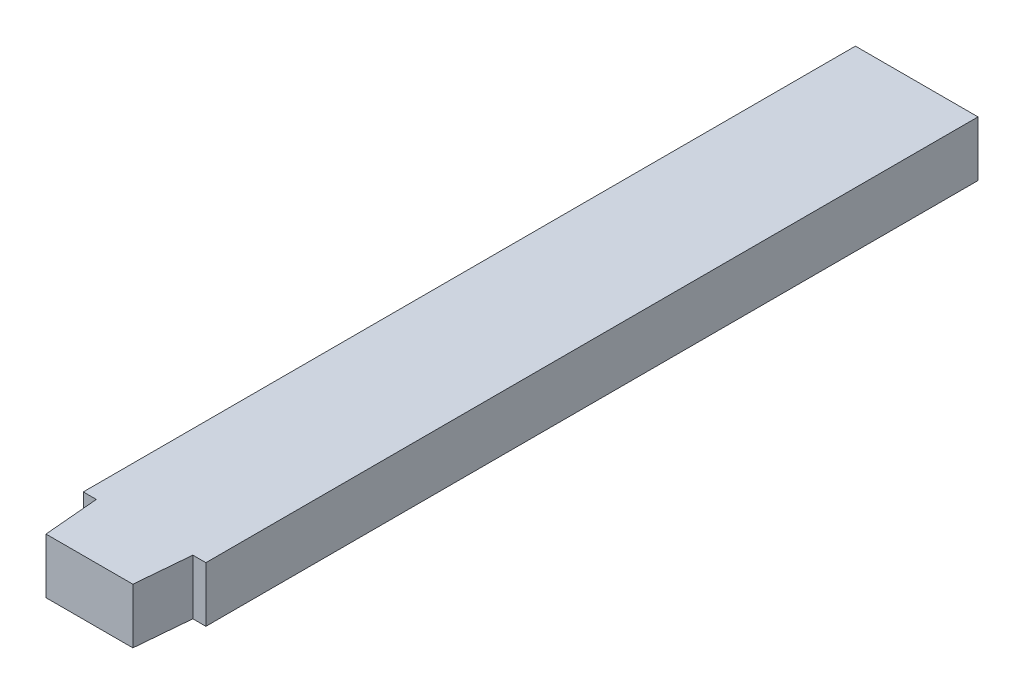
ISO-10303-21;
HEADER;
FILE_DESCRIPTION(('STEP AP214'),'2;1');
FILE_NAME('part.step','',(''),(''),'','','');
FILE_SCHEMA(('AUTOMOTIVE_DESIGN { 1 0 10303 214 1 1 1 1 }'));
ENDSEC;
DATA;
#1=APPLICATION_CONTEXT('core data for automotive mechanical design processes');
#2=APPLICATION_PROTOCOL_DEFINITION('international standard','automotive_design',2000,#1);
#3=PRODUCT_CONTEXT('',#1,'mechanical');
#4=PRODUCT('Part','Part','',(#3));
#5=PRODUCT_RELATED_PRODUCT_CATEGORY('part','',(#4));
#6=PRODUCT_DEFINITION_FORMATION('','',#4);
#7=PRODUCT_DEFINITION_CONTEXT('part definition',#1,'design');
#8=PRODUCT_DEFINITION('design','',#6,#7);
#9=PRODUCT_DEFINITION_SHAPE('','',#8);
#10=(LENGTH_UNIT() NAMED_UNIT(*) SI_UNIT(.MILLI.,.METRE.));
#11=(NAMED_UNIT(*) PLANE_ANGLE_UNIT() SI_UNIT($,.RADIAN.));
#12=(NAMED_UNIT(*) SI_UNIT($,.STERADIAN.) SOLID_ANGLE_UNIT());
#13=UNCERTAINTY_MEASURE_WITH_UNIT(LENGTH_MEASURE(1.E-05),#10,'distance_accuracy_value','');
#14=(GEOMETRIC_REPRESENTATION_CONTEXT(3) GLOBAL_UNCERTAINTY_ASSIGNED_CONTEXT((#13)) GLOBAL_UNIT_ASSIGNED_CONTEXT((#10,
#11,#12)) REPRESENTATION_CONTEXT('',''));
#15=CARTESIAN_POINT('',(0.,0.,0.));
#16=DIRECTION('',(0.,0.,1.));
#17=DIRECTION('',(1.,0.,0.));
#18=AXIS2_PLACEMENT_3D('',#15,#16,#17);
#19=CARTESIAN_POINT('',(6.35,5.715,0.));
#20=DIRECTION('',(1.,0.,0.));
#21=DIRECTION('',(0.,0.,-1.));
#22=AXIS2_PLACEMENT_3D('',#19,#20,#21);
#23=PLANE('',#22);
#24=DIRECTION('',(0.,0.,1.));
#25=VECTOR('',#24,1.);
#26=CARTESIAN_POINT('',(6.35,0.,0.));
#27=LINE('',#26,#25);
#28=CARTESIAN_POINT('',(6.34999999999999,0.,-40.));
#29=VERTEX_POINT('',#28);
#30=CARTESIAN_POINT('',(6.35,0.,40.));
#31=VERTEX_POINT('',#30);
#32=EDGE_CURVE('E128',#29,#31,#27,.T.);
#33=ORIENTED_EDGE('',*,*,#32,.F.);
#34=DIRECTION('',(0.,-1.,0.));
#35=VECTOR('',#34,1.);
#36=CARTESIAN_POINT('',(6.34999999999999,5.715,-40.));
#37=LINE('',#36,#35);
#38=CARTESIAN_POINT('',(6.34999999999999,5.715,-40.));
#39=VERTEX_POINT('',#38);
#40=EDGE_CURVE('E11',#39,#29,#37,.T.);
#41=ORIENTED_EDGE('',*,*,#40,.F.);
#42=DIRECTION('',(0.,0.,1.));
#43=VECTOR('',#42,1.);
#44=CARTESIAN_POINT('',(6.35,5.715,0.));
#45=LINE('',#44,#43);
#46=CARTESIAN_POINT('',(6.35,5.715,40.));
#47=VERTEX_POINT('',#46);
#48=EDGE_CURVE('E168',#39,#47,#45,.T.);
#49=ORIENTED_EDGE('',*,*,#48,.T.);
#50=DIRECTION('',(0.,-1.,0.));
#51=VECTOR('',#50,1.);
#52=CARTESIAN_POINT('',(6.35,5.715,40.));
#53=LINE('',#52,#51);
#54=EDGE_CURVE('E84',#47,#31,#53,.T.);
#55=ORIENTED_EDGE('',*,*,#54,.T.);
#56=EDGE_LOOP('',(#33,#41,#49,#55));
#57=FACE_BOUND('',#56,.T.);
#58=ADVANCED_FACE('F34',(#57),#23,.T.);
#59=CARTESIAN_POINT('',(0.,5.715,-40.));
#60=DIRECTION('',(0.,0.,-1.));
#61=DIRECTION('',(-1.,0.,0.));
#62=AXIS2_PLACEMENT_3D('',#59,#60,#61);
#63=PLANE('',#62);
#64=DIRECTION('',(1.,0.,0.));
#65=VECTOR('',#64,1.);
#66=CARTESIAN_POINT('',(0.,0.,-40.));
#67=LINE('',#66,#65);
#68=CARTESIAN_POINT('',(-6.35000000000001,0.,-40.));
#69=VERTEX_POINT('',#68);
#70=EDGE_CURVE('E131',#69,#29,#67,.T.);
#71=ORIENTED_EDGE('',*,*,#70,.F.);
#72=DIRECTION('',(0.,-1.,0.));
#73=VECTOR('',#72,1.);
#74=CARTESIAN_POINT('',(-6.35000000000001,5.715,-40.));
#75=LINE('',#74,#73);
#76=CARTESIAN_POINT('',(-6.35000000000001,5.715,-40.));
#77=VERTEX_POINT('',#76);
#78=EDGE_CURVE('E42',#77,#69,#75,.T.);
#79=ORIENTED_EDGE('',*,*,#78,.F.);
#80=DIRECTION('',(1.,0.,0.));
#81=VECTOR('',#80,1.);
#82=CARTESIAN_POINT('',(0.,5.715,-40.));
#83=LINE('',#82,#81);
#84=EDGE_CURVE('E167',#77,#39,#83,.T.);
#85=ORIENTED_EDGE('',*,*,#84,.T.);
#86=ORIENTED_EDGE('',*,*,#40,.T.);
#87=EDGE_LOOP('',(#71,#79,#85,#86));
#88=FACE_BOUND('',#87,.T.);
#89=ADVANCED_FACE('F166',(#88),#63,.T.);
#90=CARTESIAN_POINT('',(-6.35,5.715,0.));
#91=DIRECTION('',(1.,0.,0.));
#92=DIRECTION('',(0.,0.,-1.));
#93=AXIS2_PLACEMENT_3D('',#90,#91,#92);
#94=PLANE('',#93);
#95=DIRECTION('',(0.,0.,1.));
#96=VECTOR('',#95,1.);
#97=CARTESIAN_POINT('',(-6.35,0.,0.));
#98=LINE('',#97,#96);
#99=CARTESIAN_POINT('',(-6.35,0.,40.));
#100=VERTEX_POINT('',#99);
#101=EDGE_CURVE('E134',#69,#100,#98,.T.);
#102=ORIENTED_EDGE('',*,*,#101,.T.);
#103=DIRECTION('',(0.,-1.,0.));
#104=VECTOR('',#103,1.);
#105=CARTESIAN_POINT('',(-6.35,5.715,40.));
#106=LINE('',#105,#104);
#107=CARTESIAN_POINT('',(-6.35,5.715,40.));
#108=VERTEX_POINT('',#107);
#109=EDGE_CURVE('E150',#108,#100,#106,.T.);
#110=ORIENTED_EDGE('',*,*,#109,.F.);
#111=DIRECTION('',(0.,0.,1.));
#112=VECTOR('',#111,1.);
#113=CARTESIAN_POINT('',(-6.35,5.715,0.));
#114=LINE('',#113,#112);
#115=EDGE_CURVE('E157',#77,#108,#114,.T.);
#116=ORIENTED_EDGE('',*,*,#115,.F.);
#117=ORIENTED_EDGE('',*,*,#78,.T.);
#118=EDGE_LOOP('',(#102,#110,#116,#117));
#119=FACE_BOUND('',#118,.T.);
#120=ADVANCED_FACE('F155',(#119),#94,.F.);
#121=CARTESIAN_POINT('',(0.,5.715,40.));
#122=DIRECTION('',(0.,0.,-1.));
#123=DIRECTION('',(-1.,0.,0.));
#124=AXIS2_PLACEMENT_3D('',#121,#122,#123);
#125=PLANE('',#124);
#126=DIRECTION('',(1.,0.,0.));
#127=VECTOR('',#126,1.);
#128=CARTESIAN_POINT('',(0.,0.,40.));
#129=LINE('',#128,#127);
#130=CARTESIAN_POINT('',(-5.,0.,40.));
#131=VERTEX_POINT('',#130);
#132=EDGE_CURVE('E136',#100,#131,#129,.T.);
#133=ORIENTED_EDGE('',*,*,#132,.T.);
#134=DIRECTION('',(0.,-1.,0.));
#135=VECTOR('',#134,1.);
#136=CARTESIAN_POINT('',(-5.,5.715,40.));
#137=LINE('',#136,#135);
#138=CARTESIAN_POINT('',(-5.,5.715,40.));
#139=VERTEX_POINT('',#138);
#140=EDGE_CURVE('E147',#139,#131,#137,.T.);
#141=ORIENTED_EDGE('',*,*,#140,.F.);
#142=DIRECTION('',(1.,0.,0.));
#143=VECTOR('',#142,1.);
#144=CARTESIAN_POINT('',(0.,5.715,40.));
#145=LINE('',#144,#143);
#146=EDGE_CURVE('E125',#108,#139,#145,.T.);
#147=ORIENTED_EDGE('',*,*,#146,.F.);
#148=ORIENTED_EDGE('',*,*,#109,.T.);
#149=EDGE_LOOP('',(#133,#141,#147,#148));
#150=FACE_BOUND('',#149,.T.);
#151=ADVANCED_FACE('F175',(#150),#125,.F.);
#152=CARTESIAN_POINT('',(-8.43499824148146,5.715,0.737970099867149));
#153=DIRECTION('',(0.996194663464687,0.,-0.0871561385358437));
#154=DIRECTION('',(-0.0871561385358437,0.,-0.996194663464687));
#155=AXIS2_PLACEMENT_3D('',#152,#153,#154);
#156=PLANE('',#155);
#157=DIRECTION('',(0.0871561385358437,0.,0.996194663464687));
#158=VECTOR('',#157,1.);
#159=CARTESIAN_POINT('',(-8.43499824148146,0.,0.737970099867149));
#160=LINE('',#159,#158);
#161=CARTESIAN_POINT('',(-4.5,0.,45.715));
#162=VERTEX_POINT('',#161);
#163=EDGE_CURVE('E138',#131,#162,#160,.T.);
#164=ORIENTED_EDGE('',*,*,#163,.T.);
#165=DIRECTION('',(0.,-1.,0.));
#166=VECTOR('',#165,1.);
#167=CARTESIAN_POINT('',(-4.5,5.715,45.715));
#168=LINE('',#167,#166);
#169=CARTESIAN_POINT('',(-4.5,5.715,45.715));
#170=VERTEX_POINT('',#169);
#171=EDGE_CURVE('E120',#170,#162,#168,.T.);
#172=ORIENTED_EDGE('',*,*,#171,.F.);
#173=DIRECTION('',(0.0871561385358437,0.,0.996194663464687));
#174=VECTOR('',#173,1.);
#175=CARTESIAN_POINT('',(-8.43499824148146,5.715,0.737970099867149));
#176=LINE('',#175,#174);
#177=EDGE_CURVE('E107',#139,#170,#176,.T.);
#178=ORIENTED_EDGE('',*,*,#177,.F.);
#179=ORIENTED_EDGE('',*,*,#140,.T.);
#180=EDGE_LOOP('',(#164,#172,#178,#179));
#181=FACE_BOUND('',#180,.T.);
#182=ADVANCED_FACE('F177',(#181),#156,.F.);
#183=CARTESIAN_POINT('',(0.,5.715,45.715));
#184=DIRECTION('',(0.,0.,-1.));
#185=DIRECTION('',(-1.,0.,0.));
#186=AXIS2_PLACEMENT_3D('',#183,#184,#185);
#187=PLANE('',#186);
#188=DIRECTION('',(1.,0.,0.));
#189=VECTOR('',#188,1.);
#190=CARTESIAN_POINT('',(0.,0.,45.715));
#191=LINE('',#190,#189);
#192=CARTESIAN_POINT('',(4.5,0.,45.715));
#193=VERTEX_POINT('',#192);
#194=EDGE_CURVE('E116',#162,#193,#191,.T.);
#195=ORIENTED_EDGE('',*,*,#194,.T.);
#196=DIRECTION('',(0.,-1.,0.));
#197=VECTOR('',#196,1.);
#198=CARTESIAN_POINT('',(4.5,5.715,45.715));
#199=LINE('',#198,#197);
#200=CARTESIAN_POINT('',(4.5,5.715,45.715));
#201=VERTEX_POINT('',#200);
#202=EDGE_CURVE('E113',#201,#193,#199,.T.);
#203=ORIENTED_EDGE('',*,*,#202,.F.);
#204=DIRECTION('',(1.,0.,0.));
#205=VECTOR('',#204,1.);
#206=CARTESIAN_POINT('',(0.,5.715,45.715));
#207=LINE('',#206,#205);
#208=EDGE_CURVE('E101',#170,#201,#207,.T.);
#209=ORIENTED_EDGE('',*,*,#208,.F.);
#210=ORIENTED_EDGE('',*,*,#171,.T.);
#211=EDGE_LOOP('',(#195,#203,#209,#210));
#212=FACE_BOUND('',#211,.T.);
#213=ADVANCED_FACE('F114',(#212),#187,.F.);
#214=CARTESIAN_POINT('',(8.43499824148146,5.715,0.737970099867149));
#215=DIRECTION('',(0.996194663464687,0.,0.0871561385358437));
#216=DIRECTION('',(0.0871561385358437,0.,-0.996194663464687));
#217=AXIS2_PLACEMENT_3D('',#214,#215,#216);
#218=PLANE('',#217);
#219=DIRECTION('',(-0.0871561385358437,0.,0.996194663464687));
#220=VECTOR('',#219,1.);
#221=CARTESIAN_POINT('',(8.43499824148146,0.,0.737970099867149));
#222=LINE('',#221,#220);
#223=CARTESIAN_POINT('',(5.,0.,40.));
#224=VERTEX_POINT('',#223);
#225=EDGE_CURVE('E142',#224,#193,#222,.T.);
#226=ORIENTED_EDGE('',*,*,#225,.F.);
#227=DIRECTION('',(0.,-1.,0.));
#228=VECTOR('',#227,1.);
#229=CARTESIAN_POINT('',(5.,5.715,40.));
#230=LINE('',#229,#228);
#231=CARTESIAN_POINT('',(5.,5.715,40.));
#232=VERTEX_POINT('',#231);
#233=EDGE_CURVE('E77',#232,#224,#230,.T.);
#234=ORIENTED_EDGE('',*,*,#233,.F.);
#235=DIRECTION('',(-0.0871561385358437,0.,0.996194663464687));
#236=VECTOR('',#235,1.);
#237=CARTESIAN_POINT('',(8.43499824148146,5.715,0.737970099867149));
#238=LINE('',#237,#236);
#239=EDGE_CURVE('E105',#232,#201,#238,.T.);
#240=ORIENTED_EDGE('',*,*,#239,.T.);
#241=ORIENTED_EDGE('',*,*,#202,.T.);
#242=EDGE_LOOP('',(#226,#234,#240,#241));
#243=FACE_BOUND('',#242,.T.);
#244=ADVANCED_FACE('F122',(#243),#218,.T.);
#245=EDGE_CURVE('E139',#224,#31,#129,.T.);
#246=ORIENTED_EDGE('',*,*,#245,.T.);
#247=ORIENTED_EDGE('',*,*,#54,.F.);
#248=EDGE_CURVE('E50',#232,#47,#145,.T.);
#249=ORIENTED_EDGE('',*,*,#248,.F.);
#250=ORIENTED_EDGE('',*,*,#233,.T.);
#251=EDGE_LOOP('',(#246,#247,#249,#250));
#252=FACE_BOUND('',#251,.T.);
#253=ADVANCED_FACE('F186',(#252),#125,.F.);
#254=CARTESIAN_POINT('',(0.,5.715,0.));
#255=DIRECTION('',(0.,1.,0.));
#256=DIRECTION('',(0.,0.,1.));
#257=AXIS2_PLACEMENT_3D('',#254,#255,#256);
#258=PLANE('',#257);
#259=ORIENTED_EDGE('',*,*,#48,.F.);
#260=ORIENTED_EDGE('',*,*,#84,.F.);
#261=ORIENTED_EDGE('',*,*,#115,.T.);
#262=ORIENTED_EDGE('',*,*,#146,.T.);
#263=ORIENTED_EDGE('',*,*,#177,.T.);
#264=ORIENTED_EDGE('',*,*,#208,.T.);
#265=ORIENTED_EDGE('',*,*,#239,.F.);
#266=ORIENTED_EDGE('',*,*,#248,.T.);
#267=EDGE_LOOP('',(#259,#260,#261,#262,#263,#264,#265,#266));
#268=FACE_BOUND('',#267,.T.);
#269=ADVANCED_FACE('F103',(#268),#258,.T.);
#270=CARTESIAN_POINT('',(0.,0.,0.));
#271=DIRECTION('',(0.,1.,0.));
#272=DIRECTION('',(0.,0.,1.));
#273=AXIS2_PLACEMENT_3D('',#270,#271,#272);
#274=PLANE('',#273);
#275=ORIENTED_EDGE('',*,*,#32,.T.);
#276=ORIENTED_EDGE('',*,*,#245,.F.);
#277=ORIENTED_EDGE('',*,*,#225,.T.);
#278=ORIENTED_EDGE('',*,*,#194,.F.);
#279=ORIENTED_EDGE('',*,*,#163,.F.);
#280=ORIENTED_EDGE('',*,*,#132,.F.);
#281=ORIENTED_EDGE('',*,*,#101,.F.);
#282=ORIENTED_EDGE('',*,*,#70,.T.);
#283=EDGE_LOOP('',(#275,#276,#277,#278,#279,#280,#281,#282));
#284=FACE_BOUND('',#283,.T.);
#285=ADVANCED_FACE('F164',(#284),#274,.F.);
#286=CLOSED_SHELL('',(#58,#89,#120,#151,#182,#213,#244,#253,#269,#285));
#287=MANIFOLD_SOLID_BREP('B2',#286);
#288=ADVANCED_BREP_SHAPE_REPRESENTATION('',(#18,#287),#14);
#289=SHAPE_DEFINITION_REPRESENTATION(#9,#288);
ENDSEC;
END-ISO-10303-21;
